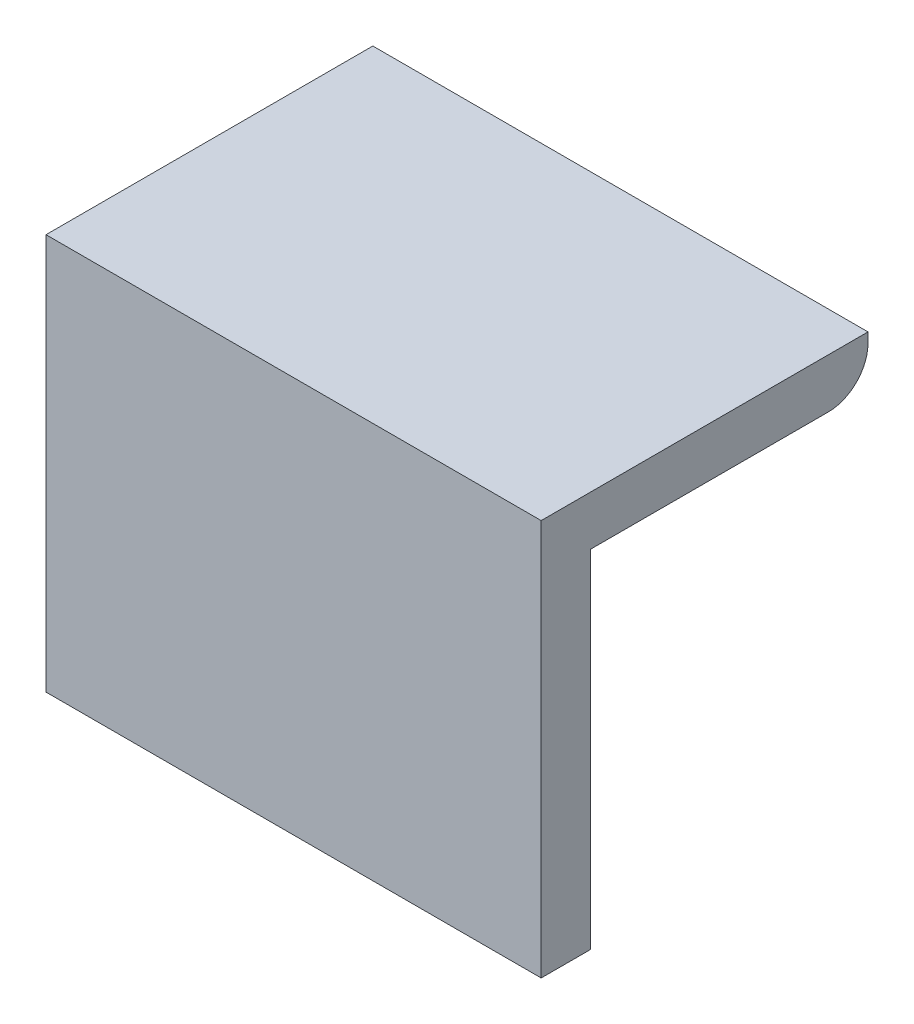
ISO-10303-21;
HEADER;
FILE_DESCRIPTION(('STEP AP214'),'2;1');
FILE_NAME('part.step','',(''),(''),'','','');
FILE_SCHEMA(('AUTOMOTIVE_DESIGN { 1 0 10303 214 1 1 1 1 }'));
ENDSEC;
DATA;
#1=APPLICATION_CONTEXT('core data for automotive mechanical design processes');
#2=APPLICATION_PROTOCOL_DEFINITION('international standard','automotive_design',2000,#1);
#3=PRODUCT_CONTEXT('',#1,'mechanical');
#4=PRODUCT('Part','Part','',(#3));
#5=PRODUCT_RELATED_PRODUCT_CATEGORY('part','',(#4));
#6=PRODUCT_DEFINITION_FORMATION('','',#4);
#7=PRODUCT_DEFINITION_CONTEXT('part definition',#1,'design');
#8=PRODUCT_DEFINITION('design','',#6,#7);
#9=PRODUCT_DEFINITION_SHAPE('','',#8);
#10=(LENGTH_UNIT() NAMED_UNIT(*) SI_UNIT(.MILLI.,.METRE.));
#11=(NAMED_UNIT(*) PLANE_ANGLE_UNIT() SI_UNIT($,.RADIAN.));
#12=(NAMED_UNIT(*) SI_UNIT($,.STERADIAN.) SOLID_ANGLE_UNIT());
#13=UNCERTAINTY_MEASURE_WITH_UNIT(LENGTH_MEASURE(1.E-05),#10,'distance_accuracy_value','');
#14=(GEOMETRIC_REPRESENTATION_CONTEXT(3) GLOBAL_UNCERTAINTY_ASSIGNED_CONTEXT((#13)) GLOBAL_UNIT_ASSIGNED_CONTEXT((#10,
#11,#12)) REPRESENTATION_CONTEXT('',''));
#15=CARTESIAN_POINT('',(0.,0.,0.));
#16=DIRECTION('',(0.,0.,1.));
#17=DIRECTION('',(1.,0.,0.));
#18=AXIS2_PLACEMENT_3D('',#15,#16,#17);
#19=CARTESIAN_POINT('',(25.,-20.,5.));
#20=DIRECTION('',(-1.,0.,0.));
#21=DIRECTION('',(0.,0.,1.));
#22=AXIS2_PLACEMENT_3D('',#19,#20,#21);
#23=PLANE('',#22);
#24=DIRECTION('',(0.,0.,1.));
#25=VECTOR('',#24,1.);
#26=CARTESIAN_POINT('',(25.,15.,-28.));
#27=LINE('',#26,#25);
#28=CARTESIAN_POINT('',(25.,15.,-24.));
#29=VERTEX_POINT('',#28);
#30=CARTESIAN_POINT('',(25.,15.,0.));
#31=VERTEX_POINT('',#30);
#32=EDGE_CURVE('E121',#29,#31,#27,.T.);
#33=ORIENTED_EDGE('',*,*,#32,.F.);
#34=CARTESIAN_POINT('',(25.,19.,-24.));
#35=DIRECTION('',(-1.,0.,0.));
#36=DIRECTION('',(0.,0.,1.));
#37=AXIS2_PLACEMENT_3D('',#34,#35,#36);
#38=CIRCLE('',#37,4.);
#39=CARTESIAN_POINT('',(25.,19.,-28.));
#40=VERTEX_POINT('',#39);
#41=EDGE_CURVE('E11',#29,#40,#38,.F.);
#42=ORIENTED_EDGE('',*,*,#41,.T.);
#43=DIRECTION('',(0.,-1.,0.));
#44=VECTOR('',#43,1.);
#45=CARTESIAN_POINT('',(25.,15.,-28.));
#46=LINE('',#45,#44);
#47=CARTESIAN_POINT('',(25.,20.,-28.));
#48=VERTEX_POINT('',#47);
#49=EDGE_CURVE('E113',#48,#40,#46,.T.);
#50=ORIENTED_EDGE('',*,*,#49,.F.);
#51=DIRECTION('',(0.,0.,-1.));
#52=VECTOR('',#51,1.);
#53=CARTESIAN_POINT('',(25.,20.,5.));
#54=LINE('',#53,#52);
#55=CARTESIAN_POINT('',(25.,20.,5.));
#56=VERTEX_POINT('',#55);
#57=EDGE_CURVE('E108',#56,#48,#54,.T.);
#58=ORIENTED_EDGE('',*,*,#57,.F.);
#59=DIRECTION('',(0.,1.,0.));
#60=VECTOR('',#59,1.);
#61=CARTESIAN_POINT('',(25.,-20.,5.));
#62=LINE('',#61,#60);
#63=CARTESIAN_POINT('',(25.,-20.,5.));
#64=VERTEX_POINT('',#63);
#65=EDGE_CURVE('E124',#64,#56,#62,.T.);
#66=ORIENTED_EDGE('',*,*,#65,.F.);
#67=DIRECTION('',(0.,0.,-1.));
#68=VECTOR('',#67,1.);
#69=CARTESIAN_POINT('',(25.,-20.,5.));
#70=LINE('',#69,#68);
#71=CARTESIAN_POINT('',(25.,-20.,0.));
#72=VERTEX_POINT('',#71);
#73=EDGE_CURVE('E133',#64,#72,#70,.T.);
#74=ORIENTED_EDGE('',*,*,#73,.T.);
#75=DIRECTION('',(0.,1.,0.));
#76=VECTOR('',#75,1.);
#77=CARTESIAN_POINT('',(25.,-20.,0.));
#78=LINE('',#77,#76);
#79=EDGE_CURVE('E123',#72,#31,#78,.T.);
#80=ORIENTED_EDGE('',*,*,#79,.T.);
#81=EDGE_LOOP('',(#33,#42,#50,#58,#66,#74,#80));
#82=FACE_BOUND('',#81,.T.);
#83=ADVANCED_FACE('F33',(#82),#23,.F.);
#84=CARTESIAN_POINT('',(-25.,20.,5.));
#85=DIRECTION('',(0.,-1.,0.));
#86=DIRECTION('',(0.,0.,-1.));
#87=AXIS2_PLACEMENT_3D('',#84,#85,#86);
#88=PLANE('',#87);
#89=ORIENTED_EDGE('',*,*,#57,.T.);
#90=DIRECTION('',(1.,0.,0.));
#91=VECTOR('',#90,1.);
#92=CARTESIAN_POINT('',(25.,20.,-28.));
#93=LINE('',#92,#91);
#94=CARTESIAN_POINT('',(-25.,20.,-28.));
#95=VERTEX_POINT('',#94);
#96=EDGE_CURVE('E95',#95,#48,#93,.T.);
#97=ORIENTED_EDGE('',*,*,#96,.F.);
#98=DIRECTION('',(0.,0.,-1.));
#99=VECTOR('',#98,1.);
#100=CARTESIAN_POINT('',(-25.,20.,5.));
#101=LINE('',#100,#99);
#102=CARTESIAN_POINT('',(-25.,20.,5.));
#103=VERTEX_POINT('',#102);
#104=EDGE_CURVE('E103',#103,#95,#101,.T.);
#105=ORIENTED_EDGE('',*,*,#104,.F.);
#106=DIRECTION('',(-1.,0.,0.));
#107=VECTOR('',#106,1.);
#108=CARTESIAN_POINT('',(-25.,20.,5.));
#109=LINE('',#108,#107);
#110=EDGE_CURVE('E127',#56,#103,#109,.T.);
#111=ORIENTED_EDGE('',*,*,#110,.F.);
#112=EDGE_LOOP('',(#89,#97,#105,#111));
#113=FACE_BOUND('',#112,.T.);
#114=ADVANCED_FACE('F111',(#113),#88,.F.);
#115=CARTESIAN_POINT('',(-25.,-20.,5.));
#116=DIRECTION('',(1.,0.,0.));
#117=DIRECTION('',(0.,0.,-1.));
#118=AXIS2_PLACEMENT_3D('',#115,#116,#117);
#119=PLANE('',#118);
#120=DIRECTION('',(0.,1.,0.));
#121=VECTOR('',#120,1.);
#122=CARTESIAN_POINT('',(-25.,15.,-28.));
#123=LINE('',#122,#121);
#124=CARTESIAN_POINT('',(-25.,19.,-28.));
#125=VERTEX_POINT('',#124);
#126=EDGE_CURVE('E90',#125,#95,#123,.T.);
#127=ORIENTED_EDGE('',*,*,#126,.F.);
#128=CARTESIAN_POINT('',(-25.,19.,-24.));
#129=DIRECTION('',(1.,0.,0.));
#130=DIRECTION('',(0.,0.,-1.));
#131=AXIS2_PLACEMENT_3D('',#128,#129,#130);
#132=CIRCLE('',#131,4.);
#133=CARTESIAN_POINT('',(-25.,15.,-24.));
#134=VERTEX_POINT('',#133);
#135=EDGE_CURVE('E55',#125,#134,#132,.F.);
#136=ORIENTED_EDGE('',*,*,#135,.T.);
#137=DIRECTION('',(0.,0.,1.));
#138=VECTOR('',#137,1.);
#139=CARTESIAN_POINT('',(-25.,15.,-28.));
#140=LINE('',#139,#138);
#141=CARTESIAN_POINT('',(-25.,15.,0.));
#142=VERTEX_POINT('',#141);
#143=EDGE_CURVE('E115',#134,#142,#140,.T.);
#144=ORIENTED_EDGE('',*,*,#143,.T.);
#145=DIRECTION('',(0.,-1.,0.));
#146=VECTOR('',#145,1.);
#147=CARTESIAN_POINT('',(-25.,-20.,0.));
#148=LINE('',#147,#146);
#149=CARTESIAN_POINT('',(-25.,-20.,0.));
#150=VERTEX_POINT('',#149);
#151=EDGE_CURVE('E136',#142,#150,#148,.T.);
#152=ORIENTED_EDGE('',*,*,#151,.T.);
#153=DIRECTION('',(0.,0.,-1.));
#154=VECTOR('',#153,1.);
#155=CARTESIAN_POINT('',(-25.,-20.,5.));
#156=LINE('',#155,#154);
#157=CARTESIAN_POINT('',(-25.,-20.,5.));
#158=VERTEX_POINT('',#157);
#159=EDGE_CURVE('E109',#158,#150,#156,.T.);
#160=ORIENTED_EDGE('',*,*,#159,.F.);
#161=DIRECTION('',(0.,-1.,0.));
#162=VECTOR('',#161,1.);
#163=CARTESIAN_POINT('',(-25.,-20.,5.));
#164=LINE('',#163,#162);
#165=EDGE_CURVE('E106',#103,#158,#164,.T.);
#166=ORIENTED_EDGE('',*,*,#165,.F.);
#167=ORIENTED_EDGE('',*,*,#104,.T.);
#168=EDGE_LOOP('',(#127,#136,#144,#152,#160,#166,#167));
#169=FACE_BOUND('',#168,.T.);
#170=ADVANCED_FACE('F104',(#169),#119,.F.);
#171=CARTESIAN_POINT('',(-25.,-20.,5.));
#172=DIRECTION('',(0.,1.,0.));
#173=DIRECTION('',(0.,0.,1.));
#174=AXIS2_PLACEMENT_3D('',#171,#172,#173);
#175=PLANE('',#174);
#176=DIRECTION('',(1.,0.,0.));
#177=VECTOR('',#176,1.);
#178=CARTESIAN_POINT('',(-25.,-20.,0.));
#179=LINE('',#178,#177);
#180=EDGE_CURVE('E128',#150,#72,#179,.T.);
#181=ORIENTED_EDGE('',*,*,#180,.T.);
#182=ORIENTED_EDGE('',*,*,#73,.F.);
#183=DIRECTION('',(1.,0.,0.));
#184=VECTOR('',#183,1.);
#185=CARTESIAN_POINT('',(-25.,-20.,5.));
#186=LINE('',#185,#184);
#187=EDGE_CURVE('E131',#158,#64,#186,.T.);
#188=ORIENTED_EDGE('',*,*,#187,.F.);
#189=ORIENTED_EDGE('',*,*,#159,.T.);
#190=EDGE_LOOP('',(#181,#182,#188,#189));
#191=FACE_BOUND('',#190,.T.);
#192=ADVANCED_FACE('F148',(#191),#175,.F.);
#193=CARTESIAN_POINT('',(0.,0.,5.));
#194=DIRECTION('',(0.,0.,-1.));
#195=DIRECTION('',(-1.,0.,0.));
#196=AXIS2_PLACEMENT_3D('',#193,#194,#195);
#197=PLANE('',#196);
#198=ORIENTED_EDGE('',*,*,#65,.T.);
#199=ORIENTED_EDGE('',*,*,#110,.T.);
#200=ORIENTED_EDGE('',*,*,#165,.T.);
#201=ORIENTED_EDGE('',*,*,#187,.T.);
#202=EDGE_LOOP('',(#198,#199,#200,#201));
#203=FACE_BOUND('',#202,.T.);
#204=ADVANCED_FACE('F159',(#203),#197,.F.);
#205=CARTESIAN_POINT('',(0.,0.,0.));
#206=DIRECTION('',(0.,0.,-1.));
#207=DIRECTION('',(-1.,0.,0.));
#208=AXIS2_PLACEMENT_3D('',#205,#206,#207);
#209=PLANE('',#208);
#210=DIRECTION('',(-1.,0.,0.));
#211=VECTOR('',#210,1.);
#212=CARTESIAN_POINT('',(25.,15.,0.));
#213=LINE('',#212,#211);
#214=EDGE_CURVE('E99',#31,#142,#213,.T.);
#215=ORIENTED_EDGE('',*,*,#214,.F.);
#216=ORIENTED_EDGE('',*,*,#79,.F.);
#217=ORIENTED_EDGE('',*,*,#180,.F.);
#218=ORIENTED_EDGE('',*,*,#151,.F.);
#219=EDGE_LOOP('',(#215,#216,#217,#218));
#220=FACE_BOUND('',#219,.T.);
#221=ADVANCED_FACE('F154',(#220),#209,.T.);
#222=CARTESIAN_POINT('',(25.,15.,-28.));
#223=DIRECTION('',(0.,1.,0.));
#224=DIRECTION('',(0.,0.,1.));
#225=AXIS2_PLACEMENT_3D('',#222,#223,#224);
#226=PLANE('',#225);
#227=ORIENTED_EDGE('',*,*,#143,.F.);
#228=DIRECTION('',(-1.,0.,0.));
#229=VECTOR('',#228,1.);
#230=CARTESIAN_POINT('',(25.,15.,-24.));
#231=LINE('',#230,#229);
#232=EDGE_CURVE('E41',#134,#29,#231,.F.);
#233=ORIENTED_EDGE('',*,*,#232,.T.);
#234=ORIENTED_EDGE('',*,*,#32,.T.);
#235=ORIENTED_EDGE('',*,*,#214,.T.);
#236=EDGE_LOOP('',(#227,#233,#234,#235));
#237=FACE_BOUND('',#236,.T.);
#238=ADVANCED_FACE('F166',(#237),#226,.F.);
#239=CARTESIAN_POINT('',(0.,0.,-28.));
#240=DIRECTION('',(0.,0.,1.));
#241=DIRECTION('',(1.,0.,0.));
#242=AXIS2_PLACEMENT_3D('',#239,#240,#241);
#243=PLANE('',#242);
#244=ORIENTED_EDGE('',*,*,#49,.T.);
#245=DIRECTION('',(-1.,0.,0.));
#246=VECTOR('',#245,1.);
#247=CARTESIAN_POINT('',(0.,19.,-28.));
#248=LINE('',#247,#246);
#249=EDGE_CURVE('E98',#40,#125,#248,.T.);
#250=ORIENTED_EDGE('',*,*,#249,.T.);
#251=ORIENTED_EDGE('',*,*,#126,.T.);
#252=ORIENTED_EDGE('',*,*,#96,.T.);
#253=EDGE_LOOP('',(#244,#250,#251,#252));
#254=FACE_BOUND('',#253,.T.);
#255=ADVANCED_FACE('F93',(#254),#243,.F.);
#256=CARTESIAN_POINT('',(0.,19.,-24.));
#257=DIRECTION('',(-1.,0.,0.));
#258=DIRECTION('',(0.,0.,1.));
#259=AXIS2_PLACEMENT_3D('',#256,#257,#258);
#260=CYLINDRICAL_SURFACE('',#259,4.);
#261=ORIENTED_EDGE('',*,*,#41,.F.);
#262=ORIENTED_EDGE('',*,*,#232,.F.);
#263=ORIENTED_EDGE('',*,*,#135,.F.);
#264=ORIENTED_EDGE('',*,*,#249,.F.);
#265=EDGE_LOOP('',(#261,#262,#263,#264));
#266=FACE_BOUND('',#265,.T.);
#267=ADVANCED_FACE('F35',(#266),#260,.T.);
#268=CLOSED_SHELL('',(#83,#114,#170,#192,#204,#221,#238,#255,#267));
#269=MANIFOLD_SOLID_BREP('B2',#268);
#270=ADVANCED_BREP_SHAPE_REPRESENTATION('',(#18,#269),#14);
#271=SHAPE_DEFINITION_REPRESENTATION(#9,#270);
ENDSEC;
END-ISO-10303-21;
